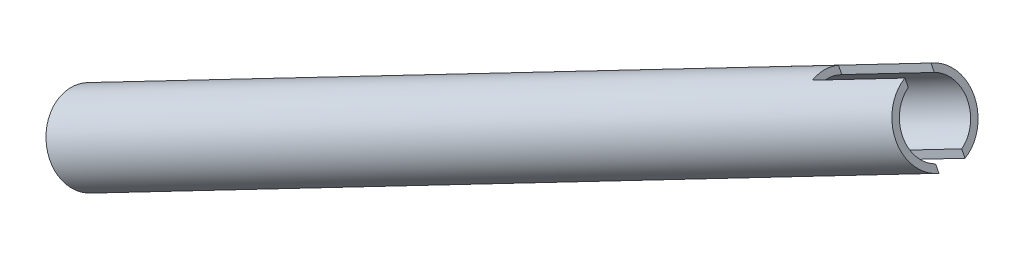
ISO-10303-21;
HEADER;
FILE_DESCRIPTION(('STEP AP214'),'2;1');
FILE_NAME('part.step','',(''),(''),'','','');
FILE_SCHEMA(('AUTOMOTIVE_DESIGN { 1 0 10303 214 1 1 1 1 }'));
ENDSEC;
DATA;
#1=APPLICATION_CONTEXT('core data for automotive mechanical design processes');
#2=APPLICATION_PROTOCOL_DEFINITION('international standard','automotive_design',2000,#1);
#3=PRODUCT_CONTEXT('',#1,'mechanical');
#4=PRODUCT('Part','Part','',(#3));
#5=PRODUCT_RELATED_PRODUCT_CATEGORY('part','',(#4));
#6=PRODUCT_DEFINITION_FORMATION('','',#4);
#7=PRODUCT_DEFINITION_CONTEXT('part definition',#1,'design');
#8=PRODUCT_DEFINITION('design','',#6,#7);
#9=PRODUCT_DEFINITION_SHAPE('','',#8);
#10=(LENGTH_UNIT() NAMED_UNIT(*) SI_UNIT(.MILLI.,.METRE.));
#11=(NAMED_UNIT(*) PLANE_ANGLE_UNIT() SI_UNIT($,.RADIAN.));
#12=(NAMED_UNIT(*) SI_UNIT($,.STERADIAN.) SOLID_ANGLE_UNIT());
#13=UNCERTAINTY_MEASURE_WITH_UNIT(LENGTH_MEASURE(1.E-05),#10,'distance_accuracy_value','');
#14=(GEOMETRIC_REPRESENTATION_CONTEXT(3) GLOBAL_UNCERTAINTY_ASSIGNED_CONTEXT((#13)) GLOBAL_UNIT_ASSIGNED_CONTEXT((#10,
#11,#12)) REPRESENTATION_CONTEXT('',''));
#15=CARTESIAN_POINT('',(0.,0.,0.));
#16=DIRECTION('',(0.,0.,1.));
#17=DIRECTION('',(1.,0.,0.));
#18=AXIS2_PLACEMENT_3D('',#15,#16,#17);
#19=CARTESIAN_POINT('',(528.662376284205,-1604.36232837028,0.));
#20=DIRECTION('',(0.88715707849716,0.46146756990322,0.));
#21=DIRECTION('',(-0.46146756990322,0.88715707849716,0.));
#22=AXIS2_PLACEMENT_3D('',#19,#20,#21);
#23=PLANE('',#22);
#24=DIRECTION('',(0.461467569903217,-0.887157078497162,0.));
#25=VECTOR('',#24,1.);
#26=CARTESIAN_POINT('',(520.633302035459,-1588.9266823615,3.175));
#27=LINE('',#26,#25);
#28=CARTESIAN_POINT('',(520.884683669489,-1589.40995574966,3.175));
#29=VERTEX_POINT('',#28);
#30=CARTESIAN_POINT('',(521.703675399395,-1590.98444192768,3.175));
#31=VERTEX_POINT('',#30);
#32=EDGE_CURVE('E164',#29,#31,#27,.T.);
#33=ORIENTED_EDGE('',*,*,#32,.F.);
#34=CARTESIAN_POINT('',(525.028780638787,-1597.37685353419,0.));
#35=DIRECTION('',(-0.88715707849716,-0.46146756990322,0.));
#36=DIRECTION('',(0.46146756990322,-0.88715707849716,0.));
#37=AXIS2_PLACEMENT_3D('',#34,#35,#36);
#38=CIRCLE('',#37,9.52499999999977);
#39=CARTESIAN_POINT('',(529.172877608085,-1605.34375131871,3.175));
#40=VERTEX_POINT('',#39);
#41=EDGE_CURVE('E135',#40,#29,#38,.T.);
#42=ORIENTED_EDGE('',*,*,#41,.F.);
#43=CARTESIAN_POINT('',(528.353885878179,-1603.76926514069,3.175));
#44=VERTEX_POINT('',#43);
#45=EDGE_CURVE('E163',#44,#40,#27,.T.);
#46=ORIENTED_EDGE('',*,*,#45,.F.);
#47=CARTESIAN_POINT('',(525.028780638787,-1597.37685353419,0.));
#48=DIRECTION('',(-0.88715707849716,-0.46146756990322,0.));
#49=DIRECTION('',(0.46146756990322,-0.88715707849716,0.));
#50=AXIS2_PLACEMENT_3D('',#47,#48,#49);
#51=CIRCLE('',#50,7.87400000000027);
#52=EDGE_CURVE('E121',#44,#31,#51,.T.);
#53=ORIENTED_EDGE('',*,*,#52,.T.);
#54=EDGE_LOOP('',(#33,#42,#46,#53));
#55=FACE_BOUND('',#54,.T.);
#56=ADVANCED_FACE('F34',(#55),#23,.T.);
#57=CARTESIAN_POINT('',(323.502507791268,-1712.94019838882,0.));
#58=DIRECTION('',(-0.88715707849716,-0.46146756990322,0.));
#59=DIRECTION('',(0.46146756990322,-0.88715707849716,0.));
#60=AXIS2_PLACEMENT_3D('',#57,#58,#59);
#61=PLANE('',#60);
#62=CARTESIAN_POINT('',(319.10702918794,-1704.49002721614,0.));
#63=DIRECTION('',(-0.88715707849716,-0.46146756990322,0.));
#64=DIRECTION('',(0.46146756990322,-0.88715707849716,0.));
#65=AXIS2_PLACEMENT_3D('',#62,#63,#64);
#66=CIRCLE('',#65,9.52499999999995);
#67=CARTESIAN_POINT('',(323.502507791268,-1712.94019838882,0.));
#68=VERTEX_POINT('',#67);
#69=EDGE_CURVE('E125',#68,#68,#66,.T.);
#70=ORIENTED_EDGE('',*,*,#69,.T.);
#71=EDGE_LOOP('',(#70));
#72=FACE_BOUND('',#71,.T.);
#73=CARTESIAN_POINT('',(319.10702918794,-1704.49002721614,0.));
#74=DIRECTION('',(-0.88715707849716,-0.46146756990322,0.));
#75=DIRECTION('',(0.46146756990322,-0.88715707849716,0.));
#76=AXIS2_PLACEMENT_3D('',#73,#74,#75);
#77=CIRCLE('',#76,7.87400000000003);
#78=CARTESIAN_POINT('',(322.740624833358,-1711.47550205222,0.));
#79=VERTEX_POINT('',#78);
#80=EDGE_CURVE('E137',#79,#79,#77,.T.);
#81=ORIENTED_EDGE('',*,*,#80,.F.);
#82=EDGE_LOOP('',(#81));
#83=FACE_BOUND('',#82,.T.);
#84=ADVANCED_FACE('F36',(#72,#83),#61,.T.);
#85=CARTESIAN_POINT('',(319.10702918794,-1704.49002721614,0.));
#86=DIRECTION('',(-0.88715707849716,-0.46146756990322,0.));
#87=DIRECTION('',(0.46146756990322,-0.88715707849716,0.));
#88=AXIS2_PLACEMENT_3D('',#85,#86,#87);
#89=CYLINDRICAL_SURFACE('',#88,7.87400000000018);
#90=DIRECTION('',(-0.88715707849716,-0.46146756990322,0.));
#91=VECTOR('',#90,1.);
#92=CARTESIAN_POINT('',(322.432134427332,-1710.88243882264,3.175));
#93=LINE('',#92,#91);
#94=CARTESIAN_POINT('',(505.820096084372,-1615.49054141622,3.175));
#95=VERTEX_POINT('',#94);
#96=EDGE_CURVE('E110',#95,#44,#93,.F.);
#97=ORIENTED_EDGE('',*,*,#96,.F.);
#98=CARTESIAN_POINT('',(502.49499084498,-1609.09812980972,0.));
#99=DIRECTION('',(0.887157078497162,0.461467569903217,0.));
#100=DIRECTION('',(-0.461467569903217,0.887157078497162,0.));
#101=AXIS2_PLACEMENT_3D('',#98,#99,#100);
#102=CIRCLE('',#101,7.87400000000018);
#103=CARTESIAN_POINT('',(505.820096084372,-1615.49054141622,-3.175));
#104=VERTEX_POINT('',#103);
#105=EDGE_CURVE('E98',#95,#104,#102,.T.);
#106=ORIENTED_EDGE('',*,*,#105,.T.);
#107=DIRECTION('',(-0.88715707849716,-0.46146756990322,0.));
#108=VECTOR('',#107,1.);
#109=CARTESIAN_POINT('',(322.432134427332,-1710.88243882264,-3.175));
#110=LINE('',#109,#108);
#111=CARTESIAN_POINT('',(528.353885878179,-1603.76926514069,-3.175));
#112=VERTEX_POINT('',#111);
#113=EDGE_CURVE('E123',#112,#104,#110,.T.);
#114=ORIENTED_EDGE('',*,*,#113,.F.);
#115=CARTESIAN_POINT('',(521.703675399395,-1590.98444192768,-3.175));
#116=VERTEX_POINT('',#115);
#117=EDGE_CURVE('E138',#116,#112,#51,.T.);
#118=ORIENTED_EDGE('',*,*,#117,.F.);
#119=DIRECTION('',(-0.88715707849716,-0.46146756990322,0.));
#120=VECTOR('',#119,1.);
#121=CARTESIAN_POINT('',(315.781923948548,-1698.09761560963,-3.175));
#122=LINE('',#121,#120);
#123=CARTESIAN_POINT('',(499.169885605588,-1602.70571820322,-3.175));
#124=VERTEX_POINT('',#123);
#125=EDGE_CURVE('E105',#124,#116,#122,.F.);
#126=ORIENTED_EDGE('',*,*,#125,.F.);
#127=CARTESIAN_POINT('',(499.169885605588,-1602.70571820322,3.175));
#128=VERTEX_POINT('',#127);
#129=EDGE_CURVE('E106',#124,#128,#102,.T.);
#130=ORIENTED_EDGE('',*,*,#129,.T.);
#131=DIRECTION('',(-0.88715707849716,-0.46146756990322,0.));
#132=VECTOR('',#131,1.);
#133=CARTESIAN_POINT('',(315.781923948548,-1698.09761560963,3.175));
#134=LINE('',#133,#132);
#135=EDGE_CURVE('E122',#31,#128,#134,.T.);
#136=ORIENTED_EDGE('',*,*,#135,.F.);
#137=ORIENTED_EDGE('',*,*,#52,.F.);
#138=EDGE_LOOP('',(#97,#106,#114,#118,#126,#130,#136,#137));
#139=FACE_BOUND('',#138,.T.);
#140=ORIENTED_EDGE('',*,*,#80,.T.);
#141=EDGE_LOOP('',(#140));
#142=FACE_BOUND('',#141,.T.);
#143=ADVANCED_FACE('F117',(#139,#142),#89,.F.);
#144=DIRECTION('',(-0.461467569903217,0.887157078497162,0.));
#145=VECTOR('',#144,1.);
#146=CARTESIAN_POINT('',(520.633302035459,-1588.9266823615,-3.175));
#147=LINE('',#146,#145);
#148=CARTESIAN_POINT('',(529.172877608085,-1605.34375131871,-3.17500000000001));
#149=VERTEX_POINT('',#148);
#150=EDGE_CURVE('E157',#149,#112,#147,.T.);
#151=ORIENTED_EDGE('',*,*,#150,.F.);
#152=CARTESIAN_POINT('',(520.884683669489,-1589.40995574966,-3.175));
#153=VERTEX_POINT('',#152);
#154=EDGE_CURVE('E132',#153,#149,#38,.T.);
#155=ORIENTED_EDGE('',*,*,#154,.F.);
#156=EDGE_CURVE('E56',#116,#153,#147,.T.);
#157=ORIENTED_EDGE('',*,*,#156,.F.);
#158=ORIENTED_EDGE('',*,*,#117,.T.);
#159=EDGE_LOOP('',(#151,#155,#157,#158));
#160=FACE_BOUND('',#159,.T.);
#161=ADVANCED_FACE('F173',(#160),#23,.T.);
#162=CARTESIAN_POINT('',(319.10702918794,-1704.49002721614,0.));
#163=DIRECTION('',(-0.88715707849716,-0.46146756990322,0.));
#164=DIRECTION('',(0.46146756990322,-0.88715707849716,0.));
#165=AXIS2_PLACEMENT_3D('',#162,#163,#164);
#166=CYLINDRICAL_SURFACE('',#165,9.52499999999987);
#167=DIRECTION('',(-0.88715707849716,-0.46146756990322,0.));
#168=VECTOR('',#167,1.);
#169=CARTESIAN_POINT('',(323.251126157238,-1712.45692500066,3.175));
#170=LINE('',#169,#168);
#171=CARTESIAN_POINT('',(506.639087814278,-1617.06502759424,3.175));
#172=VERTEX_POINT('',#171);
#173=EDGE_CURVE('E11',#40,#172,#170,.T.);
#174=ORIENTED_EDGE('',*,*,#173,.F.);
#175=ORIENTED_EDGE('',*,*,#41,.T.);
#176=DIRECTION('',(-0.88715707849716,-0.46146756990322,0.));
#177=VECTOR('',#176,1.);
#178=CARTESIAN_POINT('',(314.962932218642,-1696.52312943161,3.175));
#179=LINE('',#178,#177);
#180=CARTESIAN_POINT('',(498.350893875682,-1601.1312320252,3.175));
#181=VERTEX_POINT('',#180);
#182=EDGE_CURVE('E146',#181,#29,#179,.F.);
#183=ORIENTED_EDGE('',*,*,#182,.F.);
#184=CARTESIAN_POINT('',(502.49499084498,-1609.09812980972,0.));
#185=DIRECTION('',(0.887157078497162,0.461467569903217,0.));
#186=DIRECTION('',(-0.461467569903217,0.887157078497162,0.));
#187=AXIS2_PLACEMENT_3D('',#184,#185,#186);
#188=CIRCLE('',#187,9.52499999999987);
#189=CARTESIAN_POINT('',(498.350893875682,-1601.1312320252,-3.175));
#190=VERTEX_POINT('',#189);
#191=EDGE_CURVE('E141',#181,#190,#188,.F.);
#192=ORIENTED_EDGE('',*,*,#191,.T.);
#193=DIRECTION('',(-0.88715707849716,-0.46146756990322,0.));
#194=VECTOR('',#193,1.);
#195=CARTESIAN_POINT('',(314.962932218642,-1696.52312943161,-3.175));
#196=LINE('',#195,#194);
#197=EDGE_CURVE('E143',#153,#190,#196,.T.);
#198=ORIENTED_EDGE('',*,*,#197,.F.);
#199=ORIENTED_EDGE('',*,*,#154,.T.);
#200=DIRECTION('',(-0.88715707849716,-0.46146756990322,0.));
#201=VECTOR('',#200,1.);
#202=CARTESIAN_POINT('',(323.251126157238,-1712.45692500066,-3.175));
#203=LINE('',#202,#201);
#204=CARTESIAN_POINT('',(506.639087814278,-1617.06502759424,-3.175));
#205=VERTEX_POINT('',#204);
#206=EDGE_CURVE('E42',#205,#149,#203,.F.);
#207=ORIENTED_EDGE('',*,*,#206,.F.);
#208=EDGE_CURVE('E144',#205,#172,#188,.F.);
#209=ORIENTED_EDGE('',*,*,#208,.T.);
#210=EDGE_LOOP('',(#174,#175,#183,#192,#198,#199,#207,#209));
#211=FACE_BOUND('',#210,.T.);
#212=ORIENTED_EDGE('',*,*,#69,.F.);
#213=EDGE_LOOP('',(#212));
#214=FACE_BOUND('',#213,.T.);
#215=ADVANCED_FACE('F151',(#211,#214),#166,.T.);
#216=CARTESIAN_POINT('',(-263.267957860903,-136.942631346927,3.175));
#217=DIRECTION('',(0.887157078497162,0.461467569903217,0.));
#218=DIRECTION('',(-0.461467569903217,0.887157078497162,0.));
#219=AXIS2_PLACEMENT_3D('',#216,#217,#218);
#220=PLANE('',#219);
#221=DIRECTION('',(0.461467569903217,-0.887157078497162,0.));
#222=VECTOR('',#221,1.);
#223=CARTESIAN_POINT('',(498.099512241652,-1600.64795863703,-3.175));
#224=LINE('',#223,#222);
#225=EDGE_CURVE('E156',#190,#124,#224,.T.);
#226=ORIENTED_EDGE('',*,*,#225,.F.);
#227=ORIENTED_EDGE('',*,*,#191,.F.);
#228=DIRECTION('',(-0.461467569903217,0.887157078497162,0.));
#229=VECTOR('',#228,1.);
#230=CARTESIAN_POINT('',(498.099512241652,-1600.64795863703,3.175));
#231=LINE('',#230,#229);
#232=EDGE_CURVE('E114',#128,#181,#231,.T.);
#233=ORIENTED_EDGE('',*,*,#232,.F.);
#234=ORIENTED_EDGE('',*,*,#129,.F.);
#235=EDGE_LOOP('',(#226,#227,#233,#234));
#236=FACE_BOUND('',#235,.T.);
#237=ADVANCED_FACE('F181',(#236),#220,.T.);
#238=CARTESIAN_POINT('',(480.284987225664,-1609.91444116574,-3.175));
#239=DIRECTION('',(0.,0.,-1.));
#240=DIRECTION('',(0.,1.,0.));
#241=AXIS2_PLACEMENT_3D('',#238,#239,#240);
#242=PLANE('',#241);
#243=ORIENTED_EDGE('',*,*,#125,.T.);
#244=ORIENTED_EDGE('',*,*,#156,.T.);
#245=ORIENTED_EDGE('',*,*,#197,.T.);
#246=ORIENTED_EDGE('',*,*,#225,.T.);
#247=EDGE_LOOP('',(#243,#244,#245,#246));
#248=FACE_BOUND('',#247,.T.);
#249=ADVANCED_FACE('F167',(#248),#242,.F.);
#250=CARTESIAN_POINT('',(480.284987225664,-1609.91444116574,3.175));
#251=DIRECTION('',(0.,0.,1.));
#252=DIRECTION('',(0.,-1.,0.));
#253=AXIS2_PLACEMENT_3D('',#250,#251,#252);
#254=PLANE('',#253);
#255=ORIENTED_EDGE('',*,*,#135,.T.);
#256=ORIENTED_EDGE('',*,*,#232,.T.);
#257=ORIENTED_EDGE('',*,*,#182,.T.);
#258=ORIENTED_EDGE('',*,*,#32,.T.);
#259=EDGE_LOOP('',(#255,#256,#257,#258));
#260=FACE_BOUND('',#259,.T.);
#261=ADVANCED_FACE('F178',(#260),#254,.F.);
#262=ORIENTED_EDGE('',*,*,#113,.T.);
#263=EDGE_CURVE('E101',#104,#205,#224,.T.);
#264=ORIENTED_EDGE('',*,*,#263,.T.);
#265=ORIENTED_EDGE('',*,*,#206,.T.);
#266=ORIENTED_EDGE('',*,*,#150,.T.);
#267=EDGE_LOOP('',(#262,#264,#265,#266));
#268=FACE_BOUND('',#267,.T.);
#269=ADVANCED_FACE('F155',(#268),#242,.F.);
#270=EDGE_CURVE('E49',#172,#95,#231,.T.);
#271=ORIENTED_EDGE('',*,*,#270,.F.);
#272=ORIENTED_EDGE('',*,*,#208,.F.);
#273=ORIENTED_EDGE('',*,*,#263,.F.);
#274=ORIENTED_EDGE('',*,*,#105,.F.);
#275=EDGE_LOOP('',(#271,#272,#273,#274));
#276=FACE_BOUND('',#275,.T.);
#277=ADVANCED_FACE('F99',(#276),#220,.T.);
#278=ORIENTED_EDGE('',*,*,#96,.T.);
#279=ORIENTED_EDGE('',*,*,#45,.T.);
#280=ORIENTED_EDGE('',*,*,#173,.T.);
#281=ORIENTED_EDGE('',*,*,#270,.T.);
#282=EDGE_LOOP('',(#278,#279,#280,#281));
#283=FACE_BOUND('',#282,.T.);
#284=ADVANCED_FACE('F109',(#283),#254,.F.);
#285=CLOSED_SHELL('',(#56,#84,#143,#161,#215,#237,#249,#261,#269,#277,#284));
#286=MANIFOLD_SOLID_BREP('B2',#285);
#287=ADVANCED_BREP_SHAPE_REPRESENTATION('',(#18,#286),#14);
#288=SHAPE_DEFINITION_REPRESENTATION(#9,#287);
ENDSEC;
END-ISO-10303-21;
